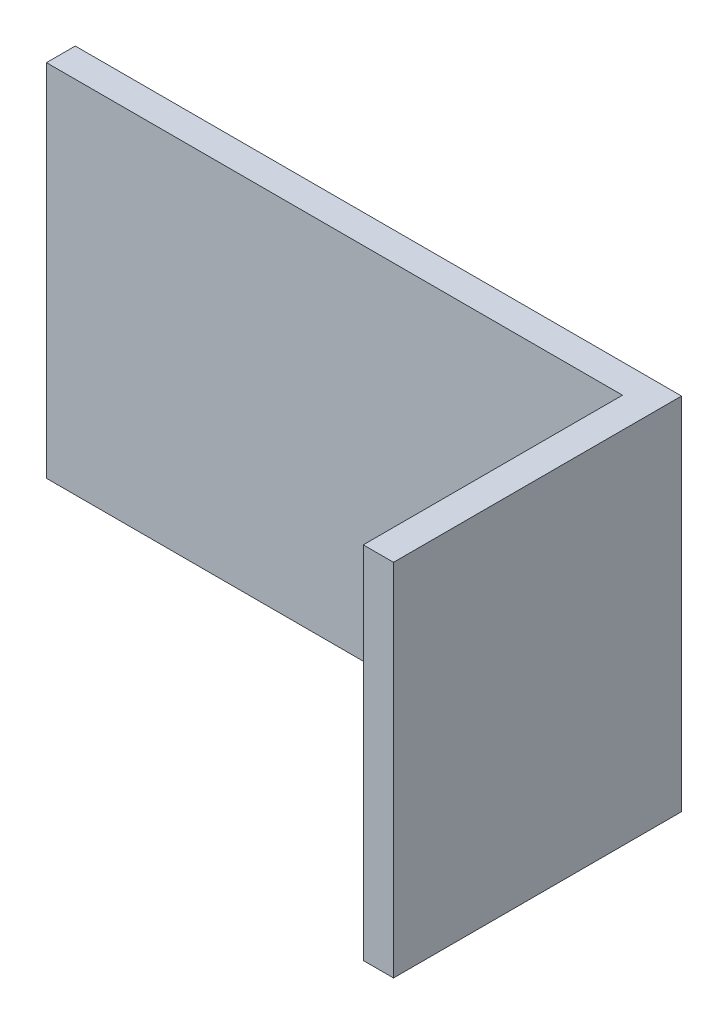
ISO-10303-21;
HEADER;
FILE_DESCRIPTION(('STEP AP214'),'2;1');
FILE_NAME('part.step','',(''),(''),'','','');
FILE_SCHEMA(('AUTOMOTIVE_DESIGN { 1 0 10303 214 1 1 1 1 }'));
ENDSEC;
DATA;
#1=APPLICATION_CONTEXT('core data for automotive mechanical design processes');
#2=APPLICATION_PROTOCOL_DEFINITION('international standard','automotive_design',2000,#1);
#3=PRODUCT_CONTEXT('',#1,'mechanical');
#4=PRODUCT('Part','Part','',(#3));
#5=PRODUCT_RELATED_PRODUCT_CATEGORY('part','',(#4));
#6=PRODUCT_DEFINITION_FORMATION('','',#4);
#7=PRODUCT_DEFINITION_CONTEXT('part definition',#1,'design');
#8=PRODUCT_DEFINITION('design','',#6,#7);
#9=PRODUCT_DEFINITION_SHAPE('','',#8);
#10=(LENGTH_UNIT() NAMED_UNIT(*) SI_UNIT(.MILLI.,.METRE.));
#11=(NAMED_UNIT(*) PLANE_ANGLE_UNIT() SI_UNIT($,.RADIAN.));
#12=(NAMED_UNIT(*) SI_UNIT($,.STERADIAN.) SOLID_ANGLE_UNIT());
#13=UNCERTAINTY_MEASURE_WITH_UNIT(LENGTH_MEASURE(1.E-05),#10,'distance_accuracy_value','');
#14=(GEOMETRIC_REPRESENTATION_CONTEXT(3) GLOBAL_UNCERTAINTY_ASSIGNED_CONTEXT((#13)) GLOBAL_UNIT_ASSIGNED_CONTEXT((#10,
#11,#12)) REPRESENTATION_CONTEXT('',''));
#15=CARTESIAN_POINT('',(0.,0.,0.));
#16=DIRECTION('',(0.,0.,1.));
#17=DIRECTION('',(1.,0.,0.));
#18=AXIS2_PLACEMENT_3D('',#15,#16,#17);
#19=CARTESIAN_POINT('',(1.48217930040456,-0.25,0.2));
#20=DIRECTION('',(0.,0.,1.));
#21=DIRECTION('',(1.,0.,0.));
#22=AXIS2_PLACEMENT_3D('',#19,#20,#21);
#23=PLANE('',#22);
#24=DIRECTION('',(0.,-1.,0.));
#25=VECTOR('',#24,1.);
#26=CARTESIAN_POINT('',(1.49267930040456,-0.25,0.2));
#27=LINE('',#26,#25);
#28=CARTESIAN_POINT('',(1.49267930040456,-0.125,0.2));
#29=VERTEX_POINT('',#28);
#30=CARTESIAN_POINT('',(1.49267930040456,-0.375,0.2));
#31=VERTEX_POINT('',#30);
#32=EDGE_CURVE('E126',#29,#31,#27,.T.);
#33=ORIENTED_EDGE('',*,*,#32,.F.);
#34=DIRECTION('',(1.,0.,0.));
#35=VECTOR('',#34,1.);
#36=CARTESIAN_POINT('',(1.34015031489732,-0.125,0.2));
#37=LINE('',#36,#35);
#38=CARTESIAN_POINT('',(1.47167930040457,-0.125,0.2));
#39=VERTEX_POINT('',#38);
#40=EDGE_CURVE('E133',#39,#29,#37,.T.);
#41=ORIENTED_EDGE('',*,*,#40,.F.);
#42=DIRECTION('',(0.,-1.,0.));
#43=VECTOR('',#42,1.);
#44=CARTESIAN_POINT('',(1.47167930040457,-0.25,0.2));
#45=LINE('',#44,#43);
#46=CARTESIAN_POINT('',(1.47167930040457,-0.375,0.2));
#47=VERTEX_POINT('',#46);
#48=EDGE_CURVE('E11',#39,#47,#45,.T.);
#49=ORIENTED_EDGE('',*,*,#48,.T.);
#50=DIRECTION('',(1.,0.,0.));
#51=VECTOR('',#50,1.);
#52=CARTESIAN_POINT('',(1.34015031489732,-0.375,0.2));
#53=LINE('',#52,#51);
#54=EDGE_CURVE('E148',#47,#31,#53,.T.);
#55=ORIENTED_EDGE('',*,*,#54,.T.);
#56=EDGE_LOOP('',(#33,#41,#49,#55));
#57=FACE_BOUND('',#56,.T.);
#58=ADVANCED_FACE('F16',(#57),#23,.T.);
#59=CARTESIAN_POINT('',(1.27167930040456,-0.25,0.02));
#60=DIRECTION('',(0.,0.,1.));
#61=DIRECTION('',(1.,0.,0.));
#62=AXIS2_PLACEMENT_3D('',#59,#60,#61);
#63=PLANE('',#62);
#64=DIRECTION('',(1.,0.,0.));
#65=VECTOR('',#64,1.);
#66=CARTESIAN_POINT('',(1.34015031489732,-0.125,0.02));
#67=LINE('',#66,#65);
#68=CARTESIAN_POINT('',(1.07167930040456,-0.125,0.02));
#69=VERTEX_POINT('',#68);
#70=CARTESIAN_POINT('',(1.47167930040457,-0.125,0.02));
#71=VERTEX_POINT('',#70);
#72=EDGE_CURVE('E139',#69,#71,#67,.T.);
#73=ORIENTED_EDGE('',*,*,#72,.F.);
#74=DIRECTION('',(0.,-1.,0.));
#75=VECTOR('',#74,1.);
#76=CARTESIAN_POINT('',(1.07167930040456,-0.25,0.02));
#77=LINE('',#76,#75);
#78=CARTESIAN_POINT('',(1.07167930040456,-0.375,0.02));
#79=VERTEX_POINT('',#78);
#80=EDGE_CURVE('E41',#69,#79,#77,.T.);
#81=ORIENTED_EDGE('',*,*,#80,.T.);
#82=DIRECTION('',(1.,0.,0.));
#83=VECTOR('',#82,1.);
#84=CARTESIAN_POINT('',(1.34015031489732,-0.375,0.02));
#85=LINE('',#84,#83);
#86=CARTESIAN_POINT('',(1.47167930040457,-0.375,0.02));
#87=VERTEX_POINT('',#86);
#88=EDGE_CURVE('E103',#79,#87,#85,.T.);
#89=ORIENTED_EDGE('',*,*,#88,.T.);
#90=DIRECTION('',(0.,1.,0.));
#91=VECTOR('',#90,1.);
#92=CARTESIAN_POINT('',(1.47167930040457,-0.25,0.02));
#93=LINE('',#92,#91);
#94=EDGE_CURVE('E27',#87,#71,#93,.T.);
#95=ORIENTED_EDGE('',*,*,#94,.T.);
#96=EDGE_LOOP('',(#73,#81,#89,#95));
#97=FACE_BOUND('',#96,.T.);
#98=ADVANCED_FACE('F168',(#97),#63,.T.);
#99=CARTESIAN_POINT('',(1.47167930040457,-0.25,0.11));
#100=DIRECTION('',(1.,0.,0.));
#101=DIRECTION('',(0.,0.,1.));
#102=AXIS2_PLACEMENT_3D('',#99,#100,#101);
#103=PLANE('',#102);
#104=DIRECTION('',(0.,0.,1.));
#105=VECTOR('',#104,1.);
#106=CARTESIAN_POINT('',(1.47167930040457,-0.125,0.0420289855072459));
#107=LINE('',#106,#105);
#108=EDGE_CURVE('E135',#71,#39,#107,.T.);
#109=ORIENTED_EDGE('',*,*,#108,.F.);
#110=ORIENTED_EDGE('',*,*,#94,.F.);
#111=DIRECTION('',(0.,0.,1.));
#112=VECTOR('',#111,1.);
#113=CARTESIAN_POINT('',(1.47167930040457,-0.375,0.0420289855072459));
#114=LINE('',#113,#112);
#115=EDGE_CURVE('E132',#87,#47,#114,.T.);
#116=ORIENTED_EDGE('',*,*,#115,.T.);
#117=ORIENTED_EDGE('',*,*,#48,.F.);
#118=EDGE_LOOP('',(#109,#110,#116,#117));
#119=FACE_BOUND('',#118,.T.);
#120=ADVANCED_FACE('F18',(#119),#103,.F.);
#121=CARTESIAN_POINT('',(1.07167930040456,-0.25,0.01));
#122=DIRECTION('',(1.,0.,0.));
#123=DIRECTION('',(0.,0.,1.));
#124=AXIS2_PLACEMENT_3D('',#121,#122,#123);
#125=PLANE('',#124);
#126=DIRECTION('',(0.,0.,1.));
#127=VECTOR('',#126,1.);
#128=CARTESIAN_POINT('',(1.07167930040456,-0.375,0.0420289855072459));
#129=LINE('',#128,#127);
#130=CARTESIAN_POINT('',(1.07167930040456,-0.375,0.));
#131=VERTEX_POINT('',#130);
#132=EDGE_CURVE('E95',#131,#79,#129,.T.);
#133=ORIENTED_EDGE('',*,*,#132,.T.);
#134=ORIENTED_EDGE('',*,*,#80,.F.);
#135=DIRECTION('',(0.,0.,1.));
#136=VECTOR('',#135,1.);
#137=CARTESIAN_POINT('',(1.07167930040456,-0.125,0.0420289855072459));
#138=LINE('',#137,#136);
#139=CARTESIAN_POINT('',(1.07167930040456,-0.125,0.));
#140=VERTEX_POINT('',#139);
#141=EDGE_CURVE('E111',#140,#69,#138,.T.);
#142=ORIENTED_EDGE('',*,*,#141,.F.);
#143=DIRECTION('',(0.,-1.,0.));
#144=VECTOR('',#143,1.);
#145=CARTESIAN_POINT('',(1.07167930040456,-0.25,0.));
#146=LINE('',#145,#144);
#147=EDGE_CURVE('E108',#140,#131,#146,.T.);
#148=ORIENTED_EDGE('',*,*,#147,.T.);
#149=EDGE_LOOP('',(#133,#134,#142,#148));
#150=FACE_BOUND('',#149,.T.);
#151=ADVANCED_FACE('F109',(#150),#125,.F.);
#152=CARTESIAN_POINT('',(1.34015031489732,-0.375,0.0420289855072459));
#153=DIRECTION('',(0.,1.,0.));
#154=DIRECTION('',(0.,0.,-1.));
#155=AXIS2_PLACEMENT_3D('',#152,#153,#154);
#156=PLANE('',#155);
#157=DIRECTION('',(0.,0.,-1.));
#158=VECTOR('',#157,1.);
#159=CARTESIAN_POINT('',(1.49267930040456,-0.375,0.0999999999999988));
#160=LINE('',#159,#158);
#161=CARTESIAN_POINT('',(1.49267930040456,-0.375,0.));
#162=VERTEX_POINT('',#161);
#163=EDGE_CURVE('E151',#31,#162,#160,.T.);
#164=ORIENTED_EDGE('',*,*,#163,.F.);
#165=ORIENTED_EDGE('',*,*,#54,.F.);
#166=ORIENTED_EDGE('',*,*,#115,.F.);
#167=ORIENTED_EDGE('',*,*,#88,.F.);
#168=ORIENTED_EDGE('',*,*,#132,.F.);
#169=DIRECTION('',(1.,0.,0.));
#170=VECTOR('',#169,1.);
#171=CARTESIAN_POINT('',(1.28217930040456,-0.375,0.));
#172=LINE('',#171,#170);
#173=EDGE_CURVE('E100',#131,#162,#172,.T.);
#174=ORIENTED_EDGE('',*,*,#173,.T.);
#175=EDGE_LOOP('',(#164,#165,#166,#167,#168,#174));
#176=FACE_BOUND('',#175,.T.);
#177=ADVANCED_FACE('F98',(#176),#156,.F.);
#178=CARTESIAN_POINT('',(1.49267930040456,-0.25,0.0999999999999988));
#179=DIRECTION('',(1.,0.,0.));
#180=DIRECTION('',(0.,1.,0.));
#181=AXIS2_PLACEMENT_3D('',#178,#179,#180);
#182=PLANE('',#181);
#183=ORIENTED_EDGE('',*,*,#32,.T.);
#184=ORIENTED_EDGE('',*,*,#163,.T.);
#185=DIRECTION('',(0.,1.,0.));
#186=VECTOR('',#185,1.);
#187=CARTESIAN_POINT('',(1.49267930040456,-0.25,0.));
#188=LINE('',#187,#186);
#189=CARTESIAN_POINT('',(1.49267930040456,-0.125,0.));
#190=VERTEX_POINT('',#189);
#191=EDGE_CURVE('E117',#162,#190,#188,.T.);
#192=ORIENTED_EDGE('',*,*,#191,.T.);
#193=DIRECTION('',(0.,0.,-1.));
#194=VECTOR('',#193,1.);
#195=CARTESIAN_POINT('',(1.49267930040456,-0.125,0.0420289855072459));
#196=LINE('',#195,#194);
#197=EDGE_CURVE('E86',#29,#190,#196,.T.);
#198=ORIENTED_EDGE('',*,*,#197,.F.);
#199=EDGE_LOOP('',(#183,#184,#192,#198));
#200=FACE_BOUND('',#199,.T.);
#201=ADVANCED_FACE('F162',(#200),#182,.T.);
#202=CARTESIAN_POINT('',(1.34015031489732,-0.125,0.0420289855072459));
#203=DIRECTION('',(0.,1.,0.));
#204=DIRECTION('',(0.,0.,-1.));
#205=AXIS2_PLACEMENT_3D('',#202,#203,#204);
#206=PLANE('',#205);
#207=ORIENTED_EDGE('',*,*,#72,.T.);
#208=ORIENTED_EDGE('',*,*,#108,.T.);
#209=ORIENTED_EDGE('',*,*,#40,.T.);
#210=ORIENTED_EDGE('',*,*,#197,.T.);
#211=DIRECTION('',(-1.,0.,0.));
#212=VECTOR('',#211,1.);
#213=CARTESIAN_POINT('',(1.28217930040456,-0.125,0.));
#214=LINE('',#213,#212);
#215=EDGE_CURVE('E20',#190,#140,#214,.T.);
#216=ORIENTED_EDGE('',*,*,#215,.T.);
#217=ORIENTED_EDGE('',*,*,#141,.T.);
#218=EDGE_LOOP('',(#207,#208,#209,#210,#216,#217));
#219=FACE_BOUND('',#218,.T.);
#220=ADVANCED_FACE('F179',(#219),#206,.T.);
#221=CARTESIAN_POINT('',(1.28217930040456,-0.25,0.));
#222=DIRECTION('',(0.,0.,1.));
#223=DIRECTION('',(1.,0.,0.));
#224=AXIS2_PLACEMENT_3D('',#221,#222,#223);
#225=PLANE('',#224);
#226=ORIENTED_EDGE('',*,*,#191,.F.);
#227=ORIENTED_EDGE('',*,*,#173,.F.);
#228=ORIENTED_EDGE('',*,*,#147,.F.);
#229=ORIENTED_EDGE('',*,*,#215,.F.);
#230=EDGE_LOOP('',(#226,#227,#228,#229));
#231=FACE_BOUND('',#230,.T.);
#232=ADVANCED_FACE('F115',(#231),#225,.F.);
#233=CLOSED_SHELL('',(#58,#98,#120,#151,#177,#201,#220,#232));
#234=MANIFOLD_SOLID_BREP('B1',#233);
#235=ADVANCED_BREP_SHAPE_REPRESENTATION('',(#18,#234),#14);
#236=SHAPE_DEFINITION_REPRESENTATION(#9,#235);
ENDSEC;
END-ISO-10303-21;
